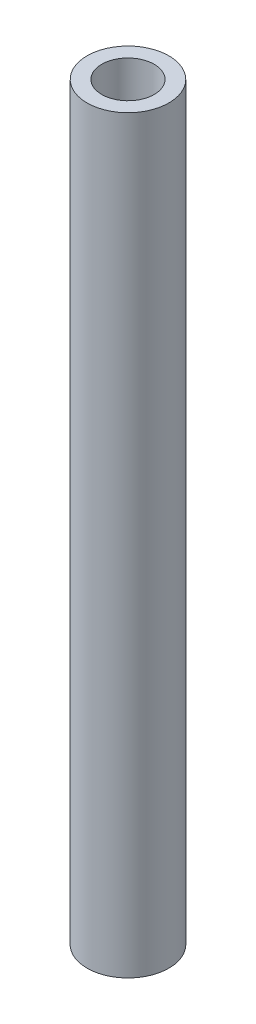
ISO-10303-21;
HEADER;
FILE_DESCRIPTION(('STEP AP214'),'2;1');
FILE_NAME('part.step','',(''),(''),'','','');
FILE_SCHEMA(('AUTOMOTIVE_DESIGN { 1 0 10303 214 1 1 1 1 }'));
ENDSEC;
DATA;
#1=APPLICATION_CONTEXT('core data for automotive mechanical design processes');
#2=APPLICATION_PROTOCOL_DEFINITION('international standard','automotive_design',2000,#1);
#3=PRODUCT_CONTEXT('',#1,'mechanical');
#4=PRODUCT('Part','Part','',(#3));
#5=PRODUCT_RELATED_PRODUCT_CATEGORY('part','',(#4));
#6=PRODUCT_DEFINITION_FORMATION('','',#4);
#7=PRODUCT_DEFINITION_CONTEXT('part definition',#1,'design');
#8=PRODUCT_DEFINITION('design','',#6,#7);
#9=PRODUCT_DEFINITION_SHAPE('','',#8);
#10=(LENGTH_UNIT() NAMED_UNIT(*) SI_UNIT(.MILLI.,.METRE.));
#11=(NAMED_UNIT(*) PLANE_ANGLE_UNIT() SI_UNIT($,.RADIAN.));
#12=(NAMED_UNIT(*) SI_UNIT($,.STERADIAN.) SOLID_ANGLE_UNIT());
#13=UNCERTAINTY_MEASURE_WITH_UNIT(LENGTH_MEASURE(1.E-05),#10,'distance_accuracy_value','');
#14=(GEOMETRIC_REPRESENTATION_CONTEXT(3) GLOBAL_UNCERTAINTY_ASSIGNED_CONTEXT((#13)) GLOBAL_UNIT_ASSIGNED_CONTEXT((#10,
#11,#12)) REPRESENTATION_CONTEXT('',''));
#15=CARTESIAN_POINT('',(0.,0.,0.));
#16=DIRECTION('',(0.,0.,1.));
#17=DIRECTION('',(1.,0.,0.));
#18=AXIS2_PLACEMENT_3D('',#15,#16,#17);
#19=CARTESIAN_POINT('',(-34.390392651239,110.,12.5610299399915));
#20=DIRECTION('',(0.,1.,0.));
#21=DIRECTION('',(0.,0.,1.));
#22=AXIS2_PLACEMENT_3D('',#19,#20,#21);
#23=PLANE('',#22);
#24=CARTESIAN_POINT('',(-34.390392651239,110.,12.5610299399915));
#25=DIRECTION('',(0.,1.,0.));
#26=DIRECTION('',(0.,0.,1.));
#27=AXIS2_PLACEMENT_3D('',#24,#25,#26);
#28=CIRCLE('',#27,6.);
#29=CARTESIAN_POINT('',(-34.390392651239,110.,18.5610299399915));
#30=VERTEX_POINT('',#29);
#31=EDGE_CURVE('E10',#30,#30,#28,.T.);
#32=ORIENTED_EDGE('',*,*,#31,.T.);
#33=EDGE_LOOP('',(#32));
#34=FACE_BOUND('',#33,.T.);
#35=CARTESIAN_POINT('',(-34.390392651239,110.,12.5610299399915));
#36=DIRECTION('',(0.,1.,0.));
#37=DIRECTION('',(0.,0.,1.));
#38=AXIS2_PLACEMENT_3D('',#35,#36,#37);
#39=CIRCLE('',#38,3.85);
#40=CARTESIAN_POINT('',(-34.390392651239,110.,16.4110299399915));
#41=VERTEX_POINT('',#40);
#42=EDGE_CURVE('E44',#41,#41,#39,.T.);
#43=ORIENTED_EDGE('',*,*,#42,.F.);
#44=EDGE_LOOP('',(#43));
#45=FACE_BOUND('',#44,.T.);
#46=ADVANCED_FACE('F33',(#34,#45),#23,.T.);
#47=CARTESIAN_POINT('',(-34.390392651239,0.,12.5610299399915));
#48=DIRECTION('',(0.,1.,0.));
#49=DIRECTION('',(0.,0.,1.));
#50=AXIS2_PLACEMENT_3D('',#47,#48,#49);
#51=PLANE('',#50);
#52=CARTESIAN_POINT('',(-34.390392651239,0.,12.5610299399915));
#53=DIRECTION('',(0.,1.,0.));
#54=DIRECTION('',(0.,0.,1.));
#55=AXIS2_PLACEMENT_3D('',#52,#53,#54);
#56=CIRCLE('',#55,6.);
#57=CARTESIAN_POINT('',(-34.390392651239,0.,18.5610299399915));
#58=VERTEX_POINT('',#57);
#59=EDGE_CURVE('E37',#58,#58,#56,.T.);
#60=ORIENTED_EDGE('',*,*,#59,.F.);
#61=EDGE_LOOP('',(#60));
#62=FACE_BOUND('',#61,.T.);
#63=CARTESIAN_POINT('',(-34.390392651239,0.,12.5610299399915));
#64=DIRECTION('',(0.,1.,0.));
#65=DIRECTION('',(0.,0.,1.));
#66=AXIS2_PLACEMENT_3D('',#63,#64,#65);
#67=CIRCLE('',#66,3.85);
#68=CARTESIAN_POINT('',(-34.390392651239,0.,16.4110299399915));
#69=VERTEX_POINT('',#68);
#70=EDGE_CURVE('E46',#69,#69,#67,.T.);
#71=ORIENTED_EDGE('',*,*,#70,.T.);
#72=EDGE_LOOP('',(#71));
#73=FACE_BOUND('',#72,.T.);
#74=ADVANCED_FACE('F56',(#62,#73),#51,.F.);
#75=CARTESIAN_POINT('',(-34.390392651239,110.,12.5610299399915));
#76=DIRECTION('',(0.,-1.,0.));
#77=DIRECTION('',(0.,0.,-1.));
#78=AXIS2_PLACEMENT_3D('',#75,#76,#77);
#79=CYLINDRICAL_SURFACE('',#78,6.);
#80=ORIENTED_EDGE('',*,*,#31,.F.);
#81=EDGE_LOOP('',(#80));
#82=FACE_BOUND('',#81,.T.);
#83=ORIENTED_EDGE('',*,*,#59,.T.);
#84=EDGE_LOOP('',(#83));
#85=FACE_BOUND('',#84,.T.);
#86=ADVANCED_FACE('F35',(#82,#85),#79,.T.);
#87=CARTESIAN_POINT('',(-34.390392651239,110.,12.5610299399915));
#88=DIRECTION('',(0.,-1.,0.));
#89=DIRECTION('',(0.,0.,-1.));
#90=AXIS2_PLACEMENT_3D('',#87,#88,#89);
#91=CYLINDRICAL_SURFACE('',#90,3.85);
#92=ORIENTED_EDGE('',*,*,#42,.T.);
#93=EDGE_LOOP('',(#92));
#94=FACE_BOUND('',#93,.T.);
#95=ORIENTED_EDGE('',*,*,#70,.F.);
#96=EDGE_LOOP('',(#95));
#97=FACE_BOUND('',#96,.T.);
#98=ADVANCED_FACE('F52',(#94,#97),#91,.F.);
#99=CLOSED_SHELL('',(#46,#74,#86,#98));
#100=MANIFOLD_SOLID_BREP('B2',#99);
#101=ADVANCED_BREP_SHAPE_REPRESENTATION('',(#18,#100),#14);
#102=SHAPE_DEFINITION_REPRESENTATION(#9,#101);
ENDSEC;
END-ISO-10303-21;
